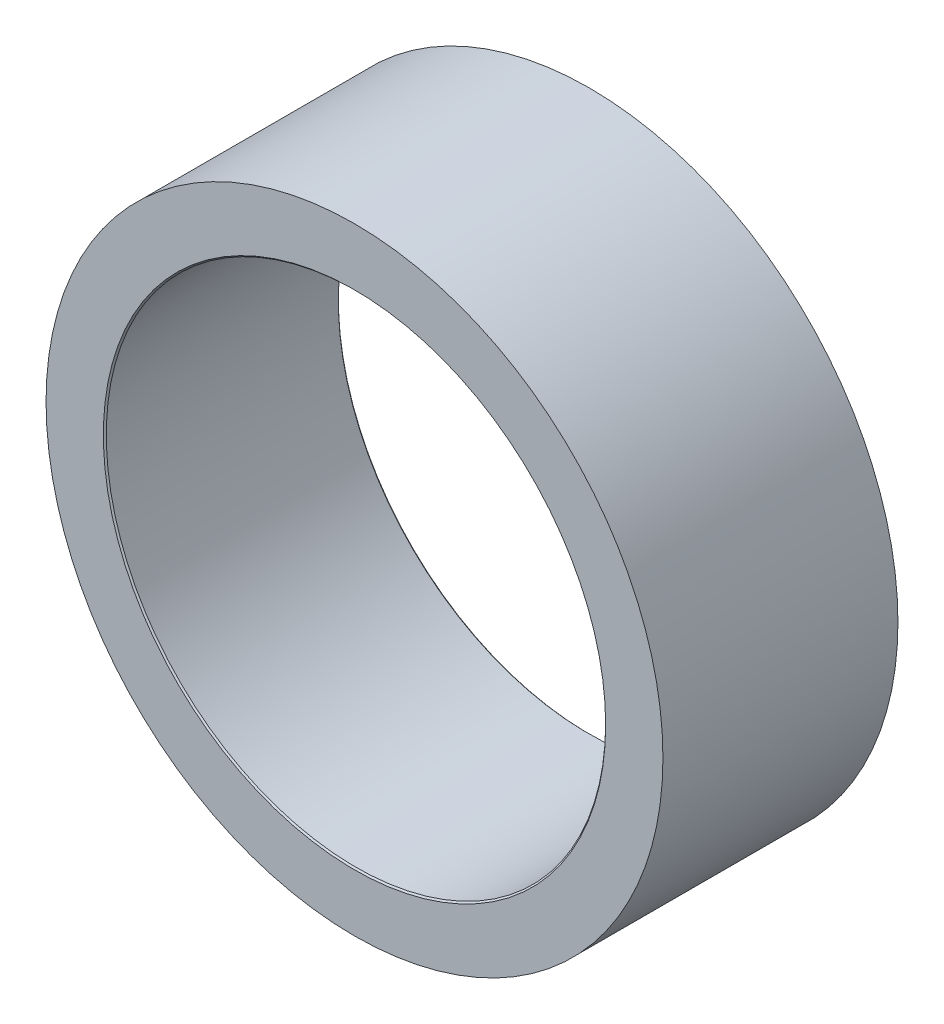
ISO-10303-21;
HEADER;
FILE_DESCRIPTION(('STEP AP214'),'2;1');
FILE_NAME('part.step','',(''),(''),'','','');
FILE_SCHEMA(('AUTOMOTIVE_DESIGN { 1 0 10303 214 1 1 1 1 }'));
ENDSEC;
DATA;
#1=APPLICATION_CONTEXT('core data for automotive mechanical design processes');
#2=APPLICATION_PROTOCOL_DEFINITION('international standard','automotive_design',2000,#1);
#3=PRODUCT_CONTEXT('',#1,'mechanical');
#4=PRODUCT('Part','Part','',(#3));
#5=PRODUCT_RELATED_PRODUCT_CATEGORY('part','',(#4));
#6=PRODUCT_DEFINITION_FORMATION('','',#4);
#7=PRODUCT_DEFINITION_CONTEXT('part definition',#1,'design');
#8=PRODUCT_DEFINITION('design','',#6,#7);
#9=PRODUCT_DEFINITION_SHAPE('','',#8);
#10=(LENGTH_UNIT() NAMED_UNIT(*) SI_UNIT(.MILLI.,.METRE.));
#11=(NAMED_UNIT(*) PLANE_ANGLE_UNIT() SI_UNIT($,.RADIAN.));
#12=(NAMED_UNIT(*) SI_UNIT($,.STERADIAN.) SOLID_ANGLE_UNIT());
#13=UNCERTAINTY_MEASURE_WITH_UNIT(LENGTH_MEASURE(1.E-05),#10,'distance_accuracy_value','');
#14=(GEOMETRIC_REPRESENTATION_CONTEXT(3) GLOBAL_UNCERTAINTY_ASSIGNED_CONTEXT((#13)) GLOBAL_UNIT_ASSIGNED_CONTEXT((#10,
#11,#12)) REPRESENTATION_CONTEXT('',''));
#15=CARTESIAN_POINT('',(0.,0.,0.));
#16=DIRECTION('',(0.,0.,1.));
#17=DIRECTION('',(1.,0.,0.));
#18=AXIS2_PLACEMENT_3D('',#15,#16,#17);
#19=CARTESIAN_POINT('',(0.,0.,-8.));
#20=DIRECTION('',(0.,0.,1.));
#21=DIRECTION('',(1.,0.,0.));
#22=AXIS2_PLACEMENT_3D('',#19,#20,#21);
#23=CYLINDRICAL_SURFACE('',#22,10.5);
#24=CARTESIAN_POINT('',(0.,0.,-8.));
#25=DIRECTION('',(0.,0.,1.));
#26=DIRECTION('',(1.,0.,0.));
#27=AXIS2_PLACEMENT_3D('',#24,#25,#26);
#28=CIRCLE('',#27,10.5);
#29=CARTESIAN_POINT('',(10.5,0.,-8.));
#30=VERTEX_POINT('',#29);
#31=EDGE_CURVE('E51',#30,#30,#28,.T.);
#32=ORIENTED_EDGE('',*,*,#31,.T.);
#33=EDGE_LOOP('',(#32));
#34=FACE_BOUND('',#33,.T.);
#35=CARTESIAN_POINT('',(0.,0.,0.));
#36=DIRECTION('',(0.,0.,1.));
#37=DIRECTION('',(1.,0.,0.));
#38=AXIS2_PLACEMENT_3D('',#35,#36,#37);
#39=CIRCLE('',#38,10.5);
#40=CARTESIAN_POINT('',(10.5,0.,0.));
#41=VERTEX_POINT('',#40);
#42=EDGE_CURVE('E52',#41,#41,#39,.T.);
#43=ORIENTED_EDGE('',*,*,#42,.F.);
#44=EDGE_LOOP('',(#43));
#45=FACE_BOUND('',#44,.T.);
#46=ADVANCED_FACE('F31',(#34,#45),#23,.T.);
#47=CARTESIAN_POINT('',(0.,0.,-8.));
#48=DIRECTION('',(0.,0.,1.));
#49=DIRECTION('',(1.,0.,0.));
#50=AXIS2_PLACEMENT_3D('',#47,#48,#49);
#51=PLANE('',#50);
#52=CARTESIAN_POINT('',(0.,0.,-8.));
#53=DIRECTION('',(0.,0.,1.));
#54=DIRECTION('',(1.,0.,0.));
#55=AXIS2_PLACEMENT_3D('',#52,#53,#54);
#56=CIRCLE('',#55,8.55);
#57=CARTESIAN_POINT('',(8.55,0.,-8.));
#58=VERTEX_POINT('',#57);
#59=EDGE_CURVE('E38',#58,#58,#56,.T.);
#60=ORIENTED_EDGE('',*,*,#59,.T.);
#61=EDGE_LOOP('',(#60));
#62=FACE_BOUND('',#61,.T.);
#63=ORIENTED_EDGE('',*,*,#31,.F.);
#64=EDGE_LOOP('',(#63));
#65=FACE_BOUND('',#64,.T.);
#66=ADVANCED_FACE('F60',(#62,#65),#51,.F.);
#67=CARTESIAN_POINT('',(0.,0.,0.));
#68=DIRECTION('',(0.,0.,1.));
#69=DIRECTION('',(1.,0.,0.));
#70=AXIS2_PLACEMENT_3D('',#67,#68,#69);
#71=PLANE('',#70);
#72=CARTESIAN_POINT('',(0.,0.,0.));
#73=DIRECTION('',(0.,0.,1.));
#74=DIRECTION('',(1.,0.,0.));
#75=AXIS2_PLACEMENT_3D('',#72,#73,#74);
#76=CIRCLE('',#75,8.55000000000001);
#77=CARTESIAN_POINT('',(8.55000000000001,0.,0.));
#78=VERTEX_POINT('',#77);
#79=EDGE_CURVE('E42',#78,#78,#76,.F.);
#80=ORIENTED_EDGE('',*,*,#79,.T.);
#81=EDGE_LOOP('',(#80));
#82=FACE_BOUND('',#81,.T.);
#83=ORIENTED_EDGE('',*,*,#42,.T.);
#84=EDGE_LOOP('',(#83));
#85=FACE_BOUND('',#84,.T.);
#86=ADVANCED_FACE('F62',(#82,#85),#71,.T.);
#87=CARTESIAN_POINT('',(0.,0.,-8.));
#88=DIRECTION('',(0.,0.,1.));
#89=DIRECTION('',(1.,0.,0.));
#90=AXIS2_PLACEMENT_3D('',#87,#88,#89);
#91=CYLINDRICAL_SURFACE('',#90,8.5);
#92=CARTESIAN_POINT('',(0.,0.,-7.95));
#93=DIRECTION('',(0.,0.,1.));
#94=DIRECTION('',(1.,0.,0.));
#95=AXIS2_PLACEMENT_3D('',#92,#93,#94);
#96=CIRCLE('',#95,8.5);
#97=CARTESIAN_POINT('',(8.5,0.,-7.95));
#98=VERTEX_POINT('',#97);
#99=EDGE_CURVE('E10',#98,#98,#96,.F.);
#100=ORIENTED_EDGE('',*,*,#99,.T.);
#101=EDGE_LOOP('',(#100));
#102=FACE_BOUND('',#101,.T.);
#103=CARTESIAN_POINT('',(0.,0.,-0.0500000000000101));
#104=DIRECTION('',(0.,0.,1.));
#105=DIRECTION('',(1.,0.,0.));
#106=AXIS2_PLACEMENT_3D('',#103,#104,#105);
#107=CIRCLE('',#106,8.5);
#108=CARTESIAN_POINT('',(8.5,0.,-0.0500000000000101));
#109=VERTEX_POINT('',#108);
#110=EDGE_CURVE('E46',#109,#109,#107,.T.);
#111=ORIENTED_EDGE('',*,*,#110,.T.);
#112=EDGE_LOOP('',(#111));
#113=FACE_BOUND('',#112,.T.);
#114=ADVANCED_FACE('F68',(#102,#113),#91,.F.);
#115=CARTESIAN_POINT('',(0.,0.,-0.0500000000000101));
#116=DIRECTION('',(0.,0.,1.));
#117=DIRECTION('',(1.,0.,0.));
#118=AXIS2_PLACEMENT_3D('',#115,#116,#117);
#119=CONICAL_SURFACE('',#118,8.5,0.785398163397431);
#120=ORIENTED_EDGE('',*,*,#79,.F.);
#121=EDGE_LOOP('',(#120));
#122=FACE_BOUND('',#121,.T.);
#123=ORIENTED_EDGE('',*,*,#110,.F.);
#124=EDGE_LOOP('',(#123));
#125=FACE_BOUND('',#124,.T.);
#126=ADVANCED_FACE('F73',(#122,#125),#119,.F.);
#127=CARTESIAN_POINT('',(0.,0.,-8.));
#128=DIRECTION('',(0.,0.,-1.));
#129=DIRECTION('',(-1.,0.,0.));
#130=AXIS2_PLACEMENT_3D('',#127,#128,#129);
#131=CONICAL_SURFACE('',#130,8.55,0.785398163397466);
#132=ORIENTED_EDGE('',*,*,#99,.F.);
#133=EDGE_LOOP('',(#132));
#134=FACE_BOUND('',#133,.T.);
#135=ORIENTED_EDGE('',*,*,#59,.F.);
#136=EDGE_LOOP('',(#135));
#137=FACE_BOUND('',#136,.T.);
#138=ADVANCED_FACE('F33',(#134,#137),#131,.F.);
#139=CLOSED_SHELL('',(#46,#66,#86,#114,#126,#138));
#140=MANIFOLD_SOLID_BREP('B2',#139);
#141=ADVANCED_BREP_SHAPE_REPRESENTATION('',(#18,#140),#14);
#142=SHAPE_DEFINITION_REPRESENTATION(#9,#141);
ENDSEC;
END-ISO-10303-21;
